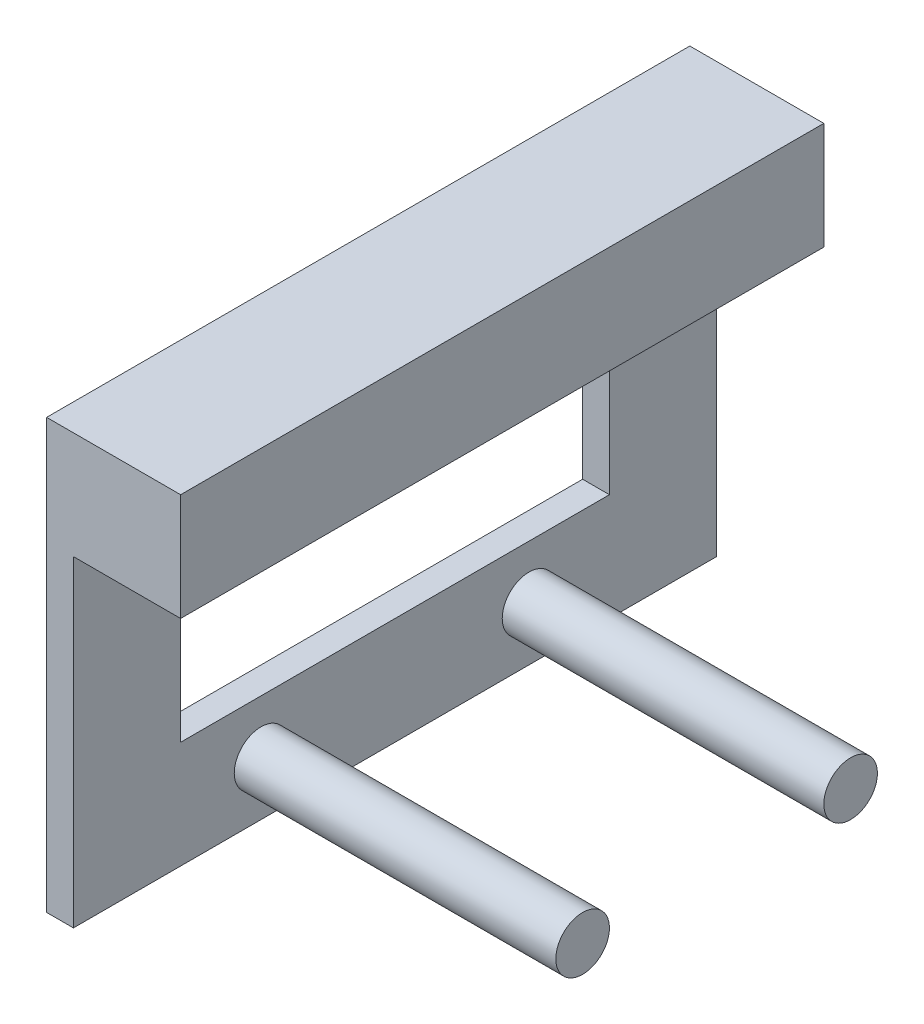
ISO-10303-21;
HEADER;
FILE_DESCRIPTION(('STEP AP214'),'2;1');
FILE_NAME('part.step','',(''),(''),'','','');
FILE_SCHEMA(('AUTOMOTIVE_DESIGN { 1 0 10303 214 1 1 1 1 }'));
ENDSEC;
DATA;
#1=APPLICATION_CONTEXT('core data for automotive mechanical design processes');
#2=APPLICATION_PROTOCOL_DEFINITION('international standard','automotive_design',2000,#1);
#3=PRODUCT_CONTEXT('',#1,'mechanical');
#4=PRODUCT('Part','Part','',(#3));
#5=PRODUCT_RELATED_PRODUCT_CATEGORY('part','',(#4));
#6=PRODUCT_DEFINITION_FORMATION('','',#4);
#7=PRODUCT_DEFINITION_CONTEXT('part definition',#1,'design');
#8=PRODUCT_DEFINITION('design','',#6,#7);
#9=PRODUCT_DEFINITION_SHAPE('','',#8);
#10=(LENGTH_UNIT() NAMED_UNIT(*) SI_UNIT(.MILLI.,.METRE.));
#11=(NAMED_UNIT(*) PLANE_ANGLE_UNIT() SI_UNIT($,.RADIAN.));
#12=(NAMED_UNIT(*) SI_UNIT($,.STERADIAN.) SOLID_ANGLE_UNIT());
#13=UNCERTAINTY_MEASURE_WITH_UNIT(LENGTH_MEASURE(1.E-05),#10,'distance_accuracy_value','');
#14=(GEOMETRIC_REPRESENTATION_CONTEXT(3) GLOBAL_UNCERTAINTY_ASSIGNED_CONTEXT((#13)) GLOBAL_UNIT_ASSIGNED_CONTEXT((#10,
#11,#12)) REPRESENTATION_CONTEXT('',''));
#15=CARTESIAN_POINT('',(0.,0.,0.));
#16=DIRECTION('',(0.,0.,1.));
#17=DIRECTION('',(1.,0.,0.));
#18=AXIS2_PLACEMENT_3D('',#15,#16,#17);
#19=CARTESIAN_POINT('',(2.5,0.,0.));
#20=DIRECTION('',(-1.,0.,0.));
#21=DIRECTION('',(0.,0.,1.));
#22=AXIS2_PLACEMENT_3D('',#19,#20,#21);
#23=PLANE('',#22);
#24=CARTESIAN_POINT('',(2.5,5.,-2.50000000000003));
#25=DIRECTION('',(-1.,0.,0.));
#26=DIRECTION('',(0.,0.,1.));
#27=AXIS2_PLACEMENT_3D('',#24,#25,#26);
#28=CIRCLE('',#27,2.5);
#29=CARTESIAN_POINT('',(2.5,5.,0.));
#30=VERTEX_POINT('',#29);
#31=EDGE_CURVE('E11',#30,#30,#28,.F.);
#32=ORIENTED_EDGE('',*,*,#31,.F.);
#33=EDGE_LOOP('',(#32));
#34=FACE_BOUND('',#33,.T.);
#35=CARTESIAN_POINT('',(2.5,5.,22.5));
#36=DIRECTION('',(-1.,0.,0.));
#37=DIRECTION('',(0.,0.,1.));
#38=AXIS2_PLACEMENT_3D('',#35,#36,#37);
#39=CIRCLE('',#38,2.5);
#40=CARTESIAN_POINT('',(2.5,5.,25.));
#41=VERTEX_POINT('',#40);
#42=EDGE_CURVE('E43',#41,#41,#39,.F.);
#43=ORIENTED_EDGE('',*,*,#42,.F.);
#44=EDGE_LOOP('',(#43));
#45=FACE_BOUND('',#44,.T.);
#46=DIRECTION('',(0.,0.,-1.));
#47=VECTOR('',#46,1.);
#48=CARTESIAN_POINT('',(2.5,30.,40.));
#49=LINE('',#48,#47);
#50=CARTESIAN_POINT('',(2.5,30.,40.));
#51=VERTEX_POINT('',#50);
#52=CARTESIAN_POINT('',(2.5,30.,30.));
#53=VERTEX_POINT('',#52);
#54=EDGE_CURVE('E50',#51,#53,#49,.T.);
#55=ORIENTED_EDGE('',*,*,#54,.F.);
#56=DIRECTION('',(0.,-1.,0.));
#57=VECTOR('',#56,1.);
#58=CARTESIAN_POINT('',(2.5,0.,40.));
#59=LINE('',#58,#57);
#60=CARTESIAN_POINT('',(2.5,0.,40.));
#61=VERTEX_POINT('',#60);
#62=EDGE_CURVE('E177',#51,#61,#59,.T.);
#63=ORIENTED_EDGE('',*,*,#62,.T.);
#64=DIRECTION('',(0.,0.,-1.));
#65=VECTOR('',#64,1.);
#66=CARTESIAN_POINT('',(2.5,0.,-40.));
#67=LINE('',#66,#65);
#68=CARTESIAN_POINT('',(2.5,0.,-20.));
#69=VERTEX_POINT('',#68);
#70=EDGE_CURVE('E179',#61,#69,#67,.T.);
#71=ORIENTED_EDGE('',*,*,#70,.T.);
#72=DIRECTION('',(0.,1.,0.));
#73=VECTOR('',#72,1.);
#74=CARTESIAN_POINT('',(2.5,0.,-20.));
#75=LINE('',#74,#73);
#76=CARTESIAN_POINT('',(2.5,30.,-20.));
#77=VERTEX_POINT('',#76);
#78=EDGE_CURVE('E57',#69,#77,#75,.T.);
#79=ORIENTED_EDGE('',*,*,#78,.T.);
#80=CARTESIAN_POINT('',(2.5,30.,-10.));
#81=VERTEX_POINT('',#80);
#82=EDGE_CURVE('E138',#81,#77,#49,.T.);
#83=ORIENTED_EDGE('',*,*,#82,.F.);
#84=DIRECTION('',(0.,-1.,0.));
#85=VECTOR('',#84,1.);
#86=CARTESIAN_POINT('',(2.5,0.,-10.));
#87=LINE('',#86,#85);
#88=CARTESIAN_POINT('',(2.5,9.99999999999999,-10.));
#89=VERTEX_POINT('',#88);
#90=EDGE_CURVE('E197',#81,#89,#87,.T.);
#91=ORIENTED_EDGE('',*,*,#90,.T.);
#92=DIRECTION('',(0.,0.,1.));
#93=VECTOR('',#92,1.);
#94=CARTESIAN_POINT('',(2.5,10.,0.));
#95=LINE('',#94,#93);
#96=CARTESIAN_POINT('',(2.5,10.,30.));
#97=VERTEX_POINT('',#96);
#98=EDGE_CURVE('E192',#89,#97,#95,.T.);
#99=ORIENTED_EDGE('',*,*,#98,.T.);
#100=DIRECTION('',(0.,1.,0.));
#101=VECTOR('',#100,1.);
#102=CARTESIAN_POINT('',(2.5,0.,30.));
#103=LINE('',#102,#101);
#104=EDGE_CURVE('E195',#97,#53,#103,.T.);
#105=ORIENTED_EDGE('',*,*,#104,.T.);
#106=EDGE_LOOP('',(#55,#63,#71,#79,#83,#91,#99,#105));
#107=FACE_BOUND('',#106,.T.);
#108=ADVANCED_FACE('F35',(#34,#45,#107),#23,.F.);
#109=CARTESIAN_POINT('',(7.5,0.,40.));
#110=DIRECTION('',(0.,0.,-1.));
#111=DIRECTION('',(-1.,0.,0.));
#112=AXIS2_PLACEMENT_3D('',#109,#110,#111);
#113=PLANE('',#112);
#114=ORIENTED_EDGE('',*,*,#62,.F.);
#115=DIRECTION('',(-1.,0.,0.));
#116=VECTOR('',#115,1.);
#117=CARTESIAN_POINT('',(12.5,30.,40.));
#118=LINE('',#117,#116);
#119=CARTESIAN_POINT('',(12.5,30.,40.));
#120=VERTEX_POINT('',#119);
#121=EDGE_CURVE('E151',#120,#51,#118,.T.);
#122=ORIENTED_EDGE('',*,*,#121,.F.);
#123=DIRECTION('',(0.,-1.,0.));
#124=VECTOR('',#123,1.);
#125=CARTESIAN_POINT('',(12.5,35.,40.));
#126=LINE('',#125,#124);
#127=CARTESIAN_POINT('',(12.5,40.,40.));
#128=VERTEX_POINT('',#127);
#129=EDGE_CURVE('E147',#128,#120,#126,.T.);
#130=ORIENTED_EDGE('',*,*,#129,.F.);
#131=DIRECTION('',(-1.,0.,0.));
#132=VECTOR('',#131,1.);
#133=CARTESIAN_POINT('',(7.5,40.,40.));
#134=LINE('',#133,#132);
#135=CARTESIAN_POINT('',(0.,40.,40.));
#136=VERTEX_POINT('',#135);
#137=EDGE_CURVE('E136',#128,#136,#134,.T.);
#138=ORIENTED_EDGE('',*,*,#137,.T.);
#139=DIRECTION('',(0.,-1.,0.));
#140=VECTOR('',#139,1.);
#141=CARTESIAN_POINT('',(0.,0.,40.));
#142=LINE('',#141,#140);
#143=CARTESIAN_POINT('',(0.,0.,40.));
#144=VERTEX_POINT('',#143);
#145=EDGE_CURVE('E181',#136,#144,#142,.T.);
#146=ORIENTED_EDGE('',*,*,#145,.T.);
#147=DIRECTION('',(-1.,0.,0.));
#148=VECTOR('',#147,1.);
#149=CARTESIAN_POINT('',(7.5,0.,40.));
#150=LINE('',#149,#148);
#151=EDGE_CURVE('E190',#61,#144,#150,.T.);
#152=ORIENTED_EDGE('',*,*,#151,.F.);
#153=EDGE_LOOP('',(#114,#122,#130,#138,#146,#152));
#154=FACE_BOUND('',#153,.T.);
#155=ADVANCED_FACE('F37',(#154),#113,.F.);
#156=CARTESIAN_POINT('',(7.5,0.,40.));
#157=DIRECTION('',(0.,1.,0.));
#158=DIRECTION('',(0.,0.,1.));
#159=AXIS2_PLACEMENT_3D('',#156,#157,#158);
#160=PLANE('',#159);
#161=DIRECTION('',(0.,0.,-1.));
#162=VECTOR('',#161,1.);
#163=CARTESIAN_POINT('',(0.,0.,40.));
#164=LINE('',#163,#162);
#165=CARTESIAN_POINT('',(0.,0.,-20.));
#166=VERTEX_POINT('',#165);
#167=EDGE_CURVE('E184',#144,#166,#164,.T.);
#168=ORIENTED_EDGE('',*,*,#167,.T.);
#169=DIRECTION('',(-1.,0.,0.));
#170=VECTOR('',#169,1.);
#171=CARTESIAN_POINT('',(10.,0.,-20.));
#172=LINE('',#171,#170);
#173=EDGE_CURVE('E123',#69,#166,#172,.T.);
#174=ORIENTED_EDGE('',*,*,#173,.F.);
#175=ORIENTED_EDGE('',*,*,#70,.F.);
#176=ORIENTED_EDGE('',*,*,#151,.T.);
#177=EDGE_LOOP('',(#168,#174,#175,#176));
#178=FACE_BOUND('',#177,.T.);
#179=ADVANCED_FACE('F210',(#178),#160,.F.);
#180=CARTESIAN_POINT('',(7.5,40.,-40.));
#181=DIRECTION('',(0.,-1.,0.));
#182=DIRECTION('',(0.,0.,-1.));
#183=AXIS2_PLACEMENT_3D('',#180,#181,#182);
#184=PLANE('',#183);
#185=ORIENTED_EDGE('',*,*,#137,.F.);
#186=DIRECTION('',(0.,0.,1.));
#187=VECTOR('',#186,1.);
#188=CARTESIAN_POINT('',(12.5,40.,40.));
#189=LINE('',#188,#187);
#190=CARTESIAN_POINT('',(12.5,40.,-20.));
#191=VERTEX_POINT('',#190);
#192=EDGE_CURVE('E129',#191,#128,#189,.T.);
#193=ORIENTED_EDGE('',*,*,#192,.F.);
#194=DIRECTION('',(-1.,0.,0.));
#195=VECTOR('',#194,1.);
#196=CARTESIAN_POINT('',(10.,40.,-20.));
#197=LINE('',#196,#195);
#198=CARTESIAN_POINT('',(0.,40.,-20.));
#199=VERTEX_POINT('',#198);
#200=EDGE_CURVE('E113',#191,#199,#197,.T.);
#201=ORIENTED_EDGE('',*,*,#200,.T.);
#202=DIRECTION('',(0.,0.,1.));
#203=VECTOR('',#202,1.);
#204=CARTESIAN_POINT('',(0.,40.,-40.));
#205=LINE('',#204,#203);
#206=EDGE_CURVE('E187',#199,#136,#205,.T.);
#207=ORIENTED_EDGE('',*,*,#206,.T.);
#208=EDGE_LOOP('',(#185,#193,#201,#207));
#209=FACE_BOUND('',#208,.T.);
#210=ADVANCED_FACE('F134',(#209),#184,.F.);
#211=CARTESIAN_POINT('',(0.,0.,0.));
#212=DIRECTION('',(1.,0.,0.));
#213=DIRECTION('',(0.,0.,-1.));
#214=AXIS2_PLACEMENT_3D('',#211,#212,#213);
#215=PLANE('',#214);
#216=DIRECTION('',(0.,0.,1.));
#217=VECTOR('',#216,1.);
#218=CARTESIAN_POINT('',(0.,10.,30.));
#219=LINE('',#218,#217);
#220=CARTESIAN_POINT('',(0.,9.99999999999999,-10.));
#221=VERTEX_POINT('',#220);
#222=CARTESIAN_POINT('',(0.,10.,30.));
#223=VERTEX_POINT('',#222);
#224=EDGE_CURVE('E156',#221,#223,#219,.T.);
#225=ORIENTED_EDGE('',*,*,#224,.F.);
#226=DIRECTION('',(0.,-1.,0.));
#227=VECTOR('',#226,1.);
#228=CARTESIAN_POINT('',(0.,9.99999999999999,-10.));
#229=LINE('',#228,#227);
#230=CARTESIAN_POINT('',(0.,30.,-10.));
#231=VERTEX_POINT('',#230);
#232=EDGE_CURVE('E154',#231,#221,#229,.T.);
#233=ORIENTED_EDGE('',*,*,#232,.F.);
#234=DIRECTION('',(0.,0.,-1.));
#235=VECTOR('',#234,1.);
#236=CARTESIAN_POINT('',(0.,30.,30.));
#237=LINE('',#236,#235);
#238=CARTESIAN_POINT('',(0.,30.,30.));
#239=VERTEX_POINT('',#238);
#240=EDGE_CURVE('E162',#239,#231,#237,.T.);
#241=ORIENTED_EDGE('',*,*,#240,.F.);
#242=DIRECTION('',(0.,1.,0.));
#243=VECTOR('',#242,1.);
#244=CARTESIAN_POINT('',(0.,10.,30.));
#245=LINE('',#244,#243);
#246=EDGE_CURVE('E159',#223,#239,#245,.T.);
#247=ORIENTED_EDGE('',*,*,#246,.F.);
#248=EDGE_LOOP('',(#225,#233,#241,#247));
#249=FACE_BOUND('',#248,.T.);
#250=ORIENTED_EDGE('',*,*,#206,.F.);
#251=DIRECTION('',(0.,1.,0.));
#252=VECTOR('',#251,1.);
#253=CARTESIAN_POINT('',(0.,40.,-20.));
#254=LINE('',#253,#252);
#255=EDGE_CURVE('E119',#166,#199,#254,.T.);
#256=ORIENTED_EDGE('',*,*,#255,.F.);
#257=ORIENTED_EDGE('',*,*,#167,.F.);
#258=ORIENTED_EDGE('',*,*,#145,.F.);
#259=EDGE_LOOP('',(#250,#256,#257,#258));
#260=FACE_BOUND('',#259,.T.);
#261=ADVANCED_FACE('F216',(#249,#260),#215,.F.);
#262=CARTESIAN_POINT('',(10.,40.,-20.));
#263=DIRECTION('',(0.,0.,1.));
#264=DIRECTION('',(0.,-1.,0.));
#265=AXIS2_PLACEMENT_3D('',#262,#263,#264);
#266=PLANE('',#265);
#267=ORIENTED_EDGE('',*,*,#200,.F.);
#268=DIRECTION('',(0.,1.,0.));
#269=VECTOR('',#268,1.);
#270=CARTESIAN_POINT('',(12.5,35.,-20.));
#271=LINE('',#270,#269);
#272=CARTESIAN_POINT('',(12.5,30.,-20.));
#273=VERTEX_POINT('',#272);
#274=EDGE_CURVE('E117',#273,#191,#271,.T.);
#275=ORIENTED_EDGE('',*,*,#274,.F.);
#276=DIRECTION('',(-1.,0.,0.));
#277=VECTOR('',#276,1.);
#278=CARTESIAN_POINT('',(12.5,30.,-20.));
#279=LINE('',#278,#277);
#280=EDGE_CURVE('E132',#273,#77,#279,.T.);
#281=ORIENTED_EDGE('',*,*,#280,.T.);
#282=ORIENTED_EDGE('',*,*,#78,.F.);
#283=ORIENTED_EDGE('',*,*,#173,.T.);
#284=ORIENTED_EDGE('',*,*,#255,.T.);
#285=EDGE_LOOP('',(#267,#275,#281,#282,#283,#284));
#286=FACE_BOUND('',#285,.T.);
#287=ADVANCED_FACE('F115',(#286),#266,.F.);
#288=CARTESIAN_POINT('',(10.,9.99999999999999,-10.));
#289=DIRECTION('',(0.,0.,-1.));
#290=DIRECTION('',(-1.,0.,0.));
#291=AXIS2_PLACEMENT_3D('',#288,#289,#290);
#292=PLANE('',#291);
#293=DIRECTION('',(-1.,0.,0.));
#294=VECTOR('',#293,1.);
#295=CARTESIAN_POINT('',(10.,30.,-10.));
#296=LINE('',#295,#294);
#297=EDGE_CURVE('E166',#81,#231,#296,.T.);
#298=ORIENTED_EDGE('',*,*,#297,.T.);
#299=ORIENTED_EDGE('',*,*,#232,.T.);
#300=DIRECTION('',(-1.,0.,0.));
#301=VECTOR('',#300,1.);
#302=CARTESIAN_POINT('',(10.,9.99999999999999,-10.));
#303=LINE('',#302,#301);
#304=EDGE_CURVE('E165',#89,#221,#303,.T.);
#305=ORIENTED_EDGE('',*,*,#304,.F.);
#306=ORIENTED_EDGE('',*,*,#90,.F.);
#307=EDGE_LOOP('',(#298,#299,#305,#306));
#308=FACE_BOUND('',#307,.T.);
#309=ADVANCED_FACE('F237',(#308),#292,.F.);
#310=CARTESIAN_POINT('',(10.,30.,30.));
#311=DIRECTION('',(0.,1.,0.));
#312=DIRECTION('',(0.,0.,1.));
#313=AXIS2_PLACEMENT_3D('',#310,#311,#312);
#314=PLANE('',#313);
#315=DIRECTION('',(-1.,0.,0.));
#316=VECTOR('',#315,1.);
#317=CARTESIAN_POINT('',(10.,30.,30.));
#318=LINE('',#317,#316);
#319=EDGE_CURVE('E168',#53,#239,#318,.T.);
#320=ORIENTED_EDGE('',*,*,#319,.T.);
#321=ORIENTED_EDGE('',*,*,#240,.T.);
#322=ORIENTED_EDGE('',*,*,#297,.F.);
#323=ORIENTED_EDGE('',*,*,#82,.T.);
#324=ORIENTED_EDGE('',*,*,#280,.F.);
#325=DIRECTION('',(0.,0.,-1.));
#326=VECTOR('',#325,1.);
#327=CARTESIAN_POINT('',(12.5,30.,40.));
#328=LINE('',#327,#326);
#329=EDGE_CURVE('E130',#120,#273,#328,.T.);
#330=ORIENTED_EDGE('',*,*,#329,.F.);
#331=ORIENTED_EDGE('',*,*,#121,.T.);
#332=ORIENTED_EDGE('',*,*,#54,.T.);
#333=EDGE_LOOP('',(#320,#321,#322,#323,#324,#330,#331,#332));
#334=FACE_BOUND('',#333,.T.);
#335=ADVANCED_FACE('F233',(#334),#314,.F.);
#336=CARTESIAN_POINT('',(10.,10.,30.));
#337=DIRECTION('',(0.,0.,1.));
#338=DIRECTION('',(1.,0.,0.));
#339=AXIS2_PLACEMENT_3D('',#336,#337,#338);
#340=PLANE('',#339);
#341=DIRECTION('',(-1.,0.,0.));
#342=VECTOR('',#341,1.);
#343=CARTESIAN_POINT('',(10.,10.,30.));
#344=LINE('',#343,#342);
#345=EDGE_CURVE('E170',#97,#223,#344,.T.);
#346=ORIENTED_EDGE('',*,*,#345,.T.);
#347=ORIENTED_EDGE('',*,*,#246,.T.);
#348=ORIENTED_EDGE('',*,*,#319,.F.);
#349=ORIENTED_EDGE('',*,*,#104,.F.);
#350=EDGE_LOOP('',(#346,#347,#348,#349));
#351=FACE_BOUND('',#350,.T.);
#352=ADVANCED_FACE('F245',(#351),#340,.F.);
#353=CARTESIAN_POINT('',(10.,10.,30.));
#354=DIRECTION('',(0.,-1.,0.));
#355=DIRECTION('',(0.,0.,-1.));
#356=AXIS2_PLACEMENT_3D('',#353,#354,#355);
#357=PLANE('',#356);
#358=ORIENTED_EDGE('',*,*,#304,.T.);
#359=ORIENTED_EDGE('',*,*,#224,.T.);
#360=ORIENTED_EDGE('',*,*,#345,.F.);
#361=ORIENTED_EDGE('',*,*,#98,.F.);
#362=EDGE_LOOP('',(#358,#359,#360,#361));
#363=FACE_BOUND('',#362,.T.);
#364=ADVANCED_FACE('F241',(#363),#357,.F.);
#365=CARTESIAN_POINT('',(12.5,0.,0.));
#366=DIRECTION('',(1.,0.,0.));
#367=DIRECTION('',(0.,0.,-1.));
#368=AXIS2_PLACEMENT_3D('',#365,#366,#367);
#369=PLANE('',#368);
#370=ORIENTED_EDGE('',*,*,#129,.T.);
#371=ORIENTED_EDGE('',*,*,#329,.T.);
#372=ORIENTED_EDGE('',*,*,#274,.T.);
#373=ORIENTED_EDGE('',*,*,#192,.T.);
#374=EDGE_LOOP('',(#370,#371,#372,#373));
#375=FACE_BOUND('',#374,.T.);
#376=ADVANCED_FACE('F128',(#375),#369,.T.);
#377=CARTESIAN_POINT('',(32.5,5.,22.5));
#378=DIRECTION('',(-1.,0.,0.));
#379=DIRECTION('',(0.,0.,1.));
#380=AXIS2_PLACEMENT_3D('',#377,#378,#379);
#381=CYLINDRICAL_SURFACE('',#380,2.5);
#382=CARTESIAN_POINT('',(32.5,5.,22.5));
#383=DIRECTION('',(1.,0.,0.));
#384=DIRECTION('',(0.,0.,-1.));
#385=AXIS2_PLACEMENT_3D('',#382,#383,#384);
#386=CIRCLE('',#385,2.5);
#387=CARTESIAN_POINT('',(32.5,5.,20.));
#388=VERTEX_POINT('',#387);
#389=EDGE_CURVE('E139',#388,#388,#386,.T.);
#390=ORIENTED_EDGE('',*,*,#389,.F.);
#391=EDGE_LOOP('',(#390));
#392=FACE_BOUND('',#391,.T.);
#393=ORIENTED_EDGE('',*,*,#42,.T.);
#394=EDGE_LOOP('',(#393));
#395=FACE_BOUND('',#394,.T.);
#396=ADVANCED_FACE('F202',(#392,#395),#381,.T.);
#397=CARTESIAN_POINT('',(32.5,5.,22.5));
#398=DIRECTION('',(1.,0.,0.));
#399=DIRECTION('',(0.,0.,-1.));
#400=AXIS2_PLACEMENT_3D('',#397,#398,#399);
#401=PLANE('',#400);
#402=ORIENTED_EDGE('',*,*,#389,.T.);
#403=EDGE_LOOP('',(#402));
#404=FACE_BOUND('',#403,.T.);
#405=ADVANCED_FACE('F341',(#404),#401,.T.);
#406=CARTESIAN_POINT('',(32.5,5.,-2.50000000000003));
#407=DIRECTION('',(-1.,0.,0.));
#408=DIRECTION('',(0.,0.,1.));
#409=AXIS2_PLACEMENT_3D('',#406,#407,#408);
#410=CYLINDRICAL_SURFACE('',#409,2.5);
#411=CARTESIAN_POINT('',(32.5,5.,-2.50000000000003));
#412=DIRECTION('',(1.,0.,0.));
#413=DIRECTION('',(0.,0.,1.));
#414=AXIS2_PLACEMENT_3D('',#411,#412,#413);
#415=CIRCLE('',#414,2.5);
#416=CARTESIAN_POINT('',(32.5,5.,0.));
#417=VERTEX_POINT('',#416);
#418=EDGE_CURVE('E143',#417,#417,#415,.T.);
#419=ORIENTED_EDGE('',*,*,#418,.F.);
#420=EDGE_LOOP('',(#419));
#421=FACE_BOUND('',#420,.T.);
#422=ORIENTED_EDGE('',*,*,#31,.T.);
#423=EDGE_LOOP('',(#422));
#424=FACE_BOUND('',#423,.T.);
#425=ADVANCED_FACE('F351',(#421,#424),#410,.T.);
#426=CARTESIAN_POINT('',(32.5,5.,-2.50000000000003));
#427=DIRECTION('',(-1.,0.,0.));
#428=DIRECTION('',(0.,0.,1.));
#429=AXIS2_PLACEMENT_3D('',#426,#427,#428);
#430=PLANE('',#429);
#431=ORIENTED_EDGE('',*,*,#418,.T.);
#432=EDGE_LOOP('',(#431));
#433=FACE_BOUND('',#432,.T.);
#434=ADVANCED_FACE('F361',(#433),#430,.F.);
#435=CLOSED_SHELL('',(#108,#155,#179,#210,#261,#287,#309,#335,#352,#364,#376,#396,#405,#425,#434));
#436=MANIFOLD_SOLID_BREP('B2',#435);
#437=ADVANCED_BREP_SHAPE_REPRESENTATION('',(#18,#436),#14);
#438=SHAPE_DEFINITION_REPRESENTATION(#9,#437);
ENDSEC;
END-ISO-10303-21;
